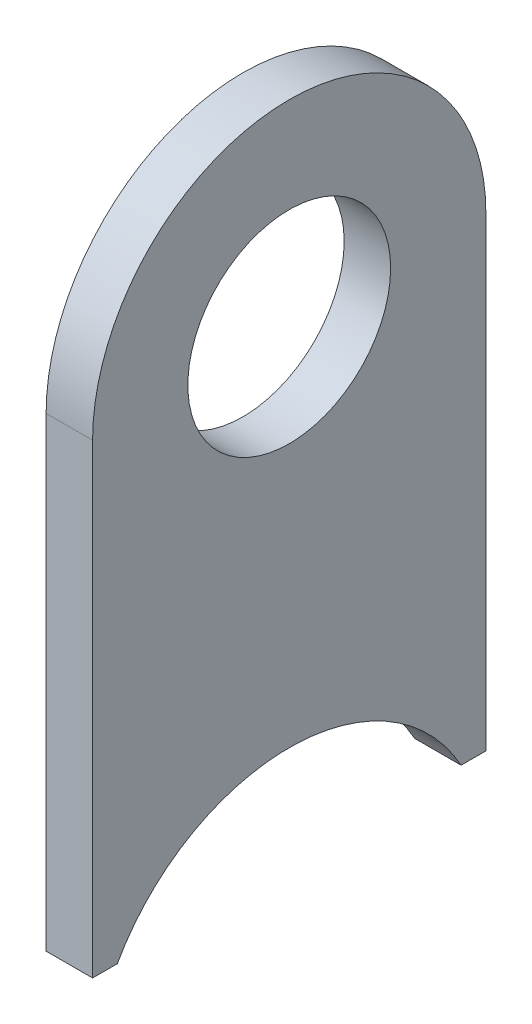
ISO-10303-21;
HEADER;
FILE_DESCRIPTION(('STEP AP214'),'2;1');
FILE_NAME('part.step','',(''),(''),'','','');
FILE_SCHEMA(('AUTOMOTIVE_DESIGN { 1 0 10303 214 1 1 1 1 }'));
ENDSEC;
DATA;
#1=APPLICATION_CONTEXT('core data for automotive mechanical design processes');
#2=APPLICATION_PROTOCOL_DEFINITION('international standard','automotive_design',2000,#1);
#3=PRODUCT_CONTEXT('',#1,'mechanical');
#4=PRODUCT('Part','Part','',(#3));
#5=PRODUCT_RELATED_PRODUCT_CATEGORY('part','',(#4));
#6=PRODUCT_DEFINITION_FORMATION('','',#4);
#7=PRODUCT_DEFINITION_CONTEXT('part definition',#1,'design');
#8=PRODUCT_DEFINITION('design','',#6,#7);
#9=PRODUCT_DEFINITION_SHAPE('','',#8);
#10=(LENGTH_UNIT() NAMED_UNIT(*) SI_UNIT(.MILLI.,.METRE.));
#11=(NAMED_UNIT(*) PLANE_ANGLE_UNIT() SI_UNIT($,.RADIAN.));
#12=(NAMED_UNIT(*) SI_UNIT($,.STERADIAN.) SOLID_ANGLE_UNIT());
#13=UNCERTAINTY_MEASURE_WITH_UNIT(LENGTH_MEASURE(1.E-05),#10,'distance_accuracy_value','');
#14=(GEOMETRIC_REPRESENTATION_CONTEXT(3) GLOBAL_UNCERTAINTY_ASSIGNED_CONTEXT((#13)) GLOBAL_UNIT_ASSIGNED_CONTEXT((#10,
#11,#12)) REPRESENTATION_CONTEXT('',''));
#15=CARTESIAN_POINT('',(0.,0.,0.));
#16=DIRECTION('',(0.,0.,1.));
#17=DIRECTION('',(1.,0.,0.));
#18=AXIS2_PLACEMENT_3D('',#15,#16,#17);
#19=CARTESIAN_POINT('',(-1.5,36.24812,0.));
#20=DIRECTION('',(1.,0.,0.));
#21=DIRECTION('',(0.,0.,-1.));
#22=AXIS2_PLACEMENT_3D('',#19,#20,#21);
#23=CYLINDRICAL_SURFACE('',#22,12.7);
#24=DIRECTION('',(1.,0.,0.));
#25=VECTOR('',#24,1.);
#26=CARTESIAN_POINT('',(-1.5,36.24812,12.7));
#27=LINE('',#26,#25);
#28=CARTESIAN_POINT('',(-1.5,36.24812,12.7));
#29=VERTEX_POINT('',#28);
#30=CARTESIAN_POINT('',(1.5,36.24812,12.7));
#31=VERTEX_POINT('',#30);
#32=EDGE_CURVE('E33',#29,#31,#27,.T.);
#33=ORIENTED_EDGE('',*,*,#32,.T.);
#34=CARTESIAN_POINT('',(1.5,36.24812,0.));
#35=DIRECTION('',(1.,0.,0.));
#36=DIRECTION('',(0.,0.,1.));
#37=AXIS2_PLACEMENT_3D('',#34,#35,#36);
#38=CIRCLE('',#37,12.7);
#39=CARTESIAN_POINT('',(1.5,36.24812,-12.7));
#40=VERTEX_POINT('',#39);
#41=EDGE_CURVE('E82',#40,#31,#38,.T.);
#42=ORIENTED_EDGE('',*,*,#41,.F.);
#43=DIRECTION('',(1.,0.,0.));
#44=VECTOR('',#43,1.);
#45=CARTESIAN_POINT('',(-1.5,36.24812,-12.7));
#46=LINE('',#45,#44);
#47=CARTESIAN_POINT('',(-1.5,36.24812,-12.7));
#48=VERTEX_POINT('',#47);
#49=EDGE_CURVE('E11',#48,#40,#46,.T.);
#50=ORIENTED_EDGE('',*,*,#49,.F.);
#51=CARTESIAN_POINT('',(-1.5,36.24812,0.));
#52=DIRECTION('',(1.,0.,0.));
#53=DIRECTION('',(0.,0.,1.));
#54=AXIS2_PLACEMENT_3D('',#51,#52,#53);
#55=CIRCLE('',#54,12.7);
#56=EDGE_CURVE('E83',#48,#29,#55,.T.);
#57=ORIENTED_EDGE('',*,*,#56,.T.);
#58=EDGE_LOOP('',(#33,#42,#50,#57));
#59=FACE_BOUND('',#58,.T.);
#60=ADVANCED_FACE('F30',(#59),#23,.T.);
#61=CARTESIAN_POINT('',(-1.5,36.24812,-12.7));
#62=DIRECTION('',(0.,0.,-1.));
#63=DIRECTION('',(0.,1.,0.));
#64=AXIS2_PLACEMENT_3D('',#61,#62,#63);
#65=PLANE('',#64);
#66=ORIENTED_EDGE('',*,*,#49,.T.);
#67=DIRECTION('',(0.,1.,0.));
#68=VECTOR('',#67,1.);
#69=CARTESIAN_POINT('',(1.5,36.24812,-12.7));
#70=LINE('',#69,#68);
#71=CARTESIAN_POINT('',(1.5,6.1708994482166,-12.7));
#72=VERTEX_POINT('',#71);
#73=EDGE_CURVE('E101',#72,#40,#70,.T.);
#74=ORIENTED_EDGE('',*,*,#73,.F.);
#75=DIRECTION('',(1.,0.,0.));
#76=VECTOR('',#75,1.);
#77=CARTESIAN_POINT('',(-1.5,6.1708994482166,-12.7));
#78=LINE('',#77,#76);
#79=CARTESIAN_POINT('',(-1.5,6.1708994482166,-12.7));
#80=VERTEX_POINT('',#79);
#81=EDGE_CURVE('E38',#80,#72,#78,.T.);
#82=ORIENTED_EDGE('',*,*,#81,.F.);
#83=DIRECTION('',(0.,1.,0.));
#84=VECTOR('',#83,1.);
#85=CARTESIAN_POINT('',(-1.5,36.24812,-12.7));
#86=LINE('',#85,#84);
#87=EDGE_CURVE('E88',#80,#48,#86,.T.);
#88=ORIENTED_EDGE('',*,*,#87,.T.);
#89=EDGE_LOOP('',(#66,#74,#82,#88));
#90=FACE_BOUND('',#89,.T.);
#91=ADVANCED_FACE('F147',(#90),#65,.T.);
#92=CARTESIAN_POINT('',(-1.5,6.1708994482166,-11.1));
#93=DIRECTION('',(0.,-1.,0.));
#94=DIRECTION('',(0.,0.,-1.));
#95=AXIS2_PLACEMENT_3D('',#92,#93,#94);
#96=PLANE('',#95);
#97=ORIENTED_EDGE('',*,*,#81,.T.);
#98=DIRECTION('',(0.,0.,-1.));
#99=VECTOR('',#98,1.);
#100=CARTESIAN_POINT('',(1.5,6.1708994482166,-11.1));
#101=LINE('',#100,#99);
#102=CARTESIAN_POINT('',(1.5,6.1708994482166,-11.1));
#103=VERTEX_POINT('',#102);
#104=EDGE_CURVE('E111',#103,#72,#101,.T.);
#105=ORIENTED_EDGE('',*,*,#104,.F.);
#106=DIRECTION('',(1.,0.,0.));
#107=VECTOR('',#106,1.);
#108=CARTESIAN_POINT('',(-1.5,6.1708994482166,-11.1));
#109=LINE('',#108,#107);
#110=CARTESIAN_POINT('',(-1.5,6.1708994482166,-11.1));
#111=VERTEX_POINT('',#110);
#112=EDGE_CURVE('E130',#111,#103,#109,.T.);
#113=ORIENTED_EDGE('',*,*,#112,.F.);
#114=DIRECTION('',(0.,0.,-1.));
#115=VECTOR('',#114,1.);
#116=CARTESIAN_POINT('',(-1.5,6.1708994482166,-11.1));
#117=LINE('',#116,#115);
#118=EDGE_CURVE('E126',#111,#80,#117,.T.);
#119=ORIENTED_EDGE('',*,*,#118,.T.);
#120=EDGE_LOOP('',(#97,#105,#113,#119));
#121=FACE_BOUND('',#120,.T.);
#122=ADVANCED_FACE('F143',(#121),#96,.T.);
#123=CARTESIAN_POINT('',(-1.5,0.,0.));
#124=DIRECTION('',(1.,0.,0.));
#125=DIRECTION('',(0.,0.,-1.));
#126=AXIS2_PLACEMENT_3D('',#123,#124,#125);
#127=CYLINDRICAL_SURFACE('',#126,12.7);
#128=ORIENTED_EDGE('',*,*,#112,.T.);
#129=CARTESIAN_POINT('',(1.5,0.,0.));
#130=DIRECTION('',(-1.,0.,0.));
#131=DIRECTION('',(0.,0.,1.));
#132=AXIS2_PLACEMENT_3D('',#129,#130,#131);
#133=CIRCLE('',#132,12.7);
#134=CARTESIAN_POINT('',(1.5,6.1708994482166,11.1));
#135=VERTEX_POINT('',#134);
#136=EDGE_CURVE('E108',#135,#103,#133,.T.);
#137=ORIENTED_EDGE('',*,*,#136,.F.);
#138=DIRECTION('',(1.,0.,0.));
#139=VECTOR('',#138,1.);
#140=CARTESIAN_POINT('',(-1.5,6.1708994482166,11.1));
#141=LINE('',#140,#139);
#142=CARTESIAN_POINT('',(-1.5,6.1708994482166,11.1));
#143=VERTEX_POINT('',#142);
#144=EDGE_CURVE('E132',#143,#135,#141,.T.);
#145=ORIENTED_EDGE('',*,*,#144,.F.);
#146=CARTESIAN_POINT('',(-1.5,0.,0.));
#147=DIRECTION('',(-1.,0.,0.));
#148=DIRECTION('',(0.,0.,1.));
#149=AXIS2_PLACEMENT_3D('',#146,#147,#148);
#150=CIRCLE('',#149,12.7);
#151=EDGE_CURVE('E123',#143,#111,#150,.T.);
#152=ORIENTED_EDGE('',*,*,#151,.T.);
#153=EDGE_LOOP('',(#128,#137,#145,#152));
#154=FACE_BOUND('',#153,.T.);
#155=ADVANCED_FACE('F140',(#154),#127,.F.);
#156=CARTESIAN_POINT('',(-1.5,6.1708994482166,11.1));
#157=DIRECTION('',(0.,-1.,0.));
#158=DIRECTION('',(0.,0.,-1.));
#159=AXIS2_PLACEMENT_3D('',#156,#157,#158);
#160=PLANE('',#159);
#161=ORIENTED_EDGE('',*,*,#144,.T.);
#162=DIRECTION('',(0.,0.,-1.));
#163=VECTOR('',#162,1.);
#164=CARTESIAN_POINT('',(1.5,6.1708994482166,11.1));
#165=LINE('',#164,#163);
#166=CARTESIAN_POINT('',(1.5,6.1708994482166,12.7));
#167=VERTEX_POINT('',#166);
#168=EDGE_CURVE('E95',#167,#135,#165,.T.);
#169=ORIENTED_EDGE('',*,*,#168,.F.);
#170=DIRECTION('',(1.,0.,0.));
#171=VECTOR('',#170,1.);
#172=CARTESIAN_POINT('',(-1.5,6.1708994482166,12.7));
#173=LINE('',#172,#171);
#174=CARTESIAN_POINT('',(-1.5,6.1708994482166,12.7));
#175=VERTEX_POINT('',#174);
#176=EDGE_CURVE('E87',#175,#167,#173,.T.);
#177=ORIENTED_EDGE('',*,*,#176,.F.);
#178=DIRECTION('',(0.,0.,-1.));
#179=VECTOR('',#178,1.);
#180=CARTESIAN_POINT('',(-1.5,6.1708994482166,11.1));
#181=LINE('',#180,#179);
#182=EDGE_CURVE('E120',#175,#143,#181,.T.);
#183=ORIENTED_EDGE('',*,*,#182,.T.);
#184=EDGE_LOOP('',(#161,#169,#177,#183));
#185=FACE_BOUND('',#184,.T.);
#186=ADVANCED_FACE('F134',(#185),#160,.T.);
#187=CARTESIAN_POINT('',(-1.5,36.24812,12.7));
#188=DIRECTION('',(0.,0.,1.));
#189=DIRECTION('',(0.,-1.,0.));
#190=AXIS2_PLACEMENT_3D('',#187,#188,#189);
#191=PLANE('',#190);
#192=ORIENTED_EDGE('',*,*,#176,.T.);
#193=DIRECTION('',(0.,-1.,0.));
#194=VECTOR('',#193,1.);
#195=CARTESIAN_POINT('',(1.5,36.24812,12.7));
#196=LINE('',#195,#194);
#197=EDGE_CURVE('E90',#31,#167,#196,.T.);
#198=ORIENTED_EDGE('',*,*,#197,.F.);
#199=ORIENTED_EDGE('',*,*,#32,.F.);
#200=DIRECTION('',(0.,-1.,0.));
#201=VECTOR('',#200,1.);
#202=CARTESIAN_POINT('',(-1.5,36.24812,12.7));
#203=LINE('',#202,#201);
#204=EDGE_CURVE('E118',#29,#175,#203,.T.);
#205=ORIENTED_EDGE('',*,*,#204,.T.);
#206=EDGE_LOOP('',(#192,#198,#199,#205));
#207=FACE_BOUND('',#206,.T.);
#208=ADVANCED_FACE('F91',(#207),#191,.T.);
#209=CARTESIAN_POINT('',(-1.5,36.24812,0.));
#210=DIRECTION('',(-1.,0.,0.));
#211=DIRECTION('',(0.,0.,1.));
#212=AXIS2_PLACEMENT_3D('',#209,#210,#211);
#213=PLANE('',#212);
#214=CARTESIAN_POINT('',(-1.5,36.24812,0.));
#215=DIRECTION('',(1.,0.,0.));
#216=DIRECTION('',(0.,0.,-1.));
#217=AXIS2_PLACEMENT_3D('',#214,#215,#216);
#218=CIRCLE('',#217,6.54811999999999);
#219=CARTESIAN_POINT('',(-1.5,36.24812,-6.54811999999999));
#220=VERTEX_POINT('',#219);
#221=EDGE_CURVE('E114',#220,#220,#218,.T.);
#222=ORIENTED_EDGE('',*,*,#221,.T.);
#223=EDGE_LOOP('',(#222));
#224=FACE_BOUND('',#223,.T.);
#225=ORIENTED_EDGE('',*,*,#56,.F.);
#226=ORIENTED_EDGE('',*,*,#87,.F.);
#227=ORIENTED_EDGE('',*,*,#118,.F.);
#228=ORIENTED_EDGE('',*,*,#151,.F.);
#229=ORIENTED_EDGE('',*,*,#182,.F.);
#230=ORIENTED_EDGE('',*,*,#204,.F.);
#231=EDGE_LOOP('',(#225,#226,#227,#228,#229,#230));
#232=FACE_BOUND('',#231,.T.);
#233=ADVANCED_FACE('F146',(#224,#232),#213,.T.);
#234=CARTESIAN_POINT('',(-1.5,36.24812,0.));
#235=DIRECTION('',(1.,0.,0.));
#236=DIRECTION('',(0.,0.,-1.));
#237=AXIS2_PLACEMENT_3D('',#234,#235,#236);
#238=CYLINDRICAL_SURFACE('',#237,6.54811999999999);
#239=ORIENTED_EDGE('',*,*,#221,.F.);
#240=EDGE_LOOP('',(#239));
#241=FACE_BOUND('',#240,.T.);
#242=CARTESIAN_POINT('',(1.5,36.24812,0.));
#243=DIRECTION('',(1.,0.,0.));
#244=DIRECTION('',(0.,0.,-1.));
#245=AXIS2_PLACEMENT_3D('',#242,#243,#244);
#246=CIRCLE('',#245,6.54811999999999);
#247=CARTESIAN_POINT('',(1.5,36.24812,-6.54811999999999));
#248=VERTEX_POINT('',#247);
#249=EDGE_CURVE('E102',#248,#248,#246,.T.);
#250=ORIENTED_EDGE('',*,*,#249,.T.);
#251=EDGE_LOOP('',(#250));
#252=FACE_BOUND('',#251,.T.);
#253=ADVANCED_FACE('F165',(#241,#252),#238,.F.);
#254=CARTESIAN_POINT('',(1.5,36.24812,0.));
#255=DIRECTION('',(-1.,0.,0.));
#256=DIRECTION('',(0.,0.,1.));
#257=AXIS2_PLACEMENT_3D('',#254,#255,#256);
#258=PLANE('',#257);
#259=ORIENTED_EDGE('',*,*,#41,.T.);
#260=ORIENTED_EDGE('',*,*,#197,.T.);
#261=ORIENTED_EDGE('',*,*,#168,.T.);
#262=ORIENTED_EDGE('',*,*,#136,.T.);
#263=ORIENTED_EDGE('',*,*,#104,.T.);
#264=ORIENTED_EDGE('',*,*,#73,.T.);
#265=EDGE_LOOP('',(#259,#260,#261,#262,#263,#264));
#266=FACE_BOUND('',#265,.T.);
#267=ORIENTED_EDGE('',*,*,#249,.F.);
#268=EDGE_LOOP('',(#267));
#269=FACE_BOUND('',#268,.T.);
#270=ADVANCED_FACE('F98',(#266,#269),#258,.F.);
#271=CLOSED_SHELL('',(#60,#91,#122,#155,#186,#208,#233,#253,#270));
#272=MANIFOLD_SOLID_BREP('B2',#271);
#273=ADVANCED_BREP_SHAPE_REPRESENTATION('',(#18,#272),#14);
#274=SHAPE_DEFINITION_REPRESENTATION(#9,#273);
ENDSEC;
END-ISO-10303-21;
